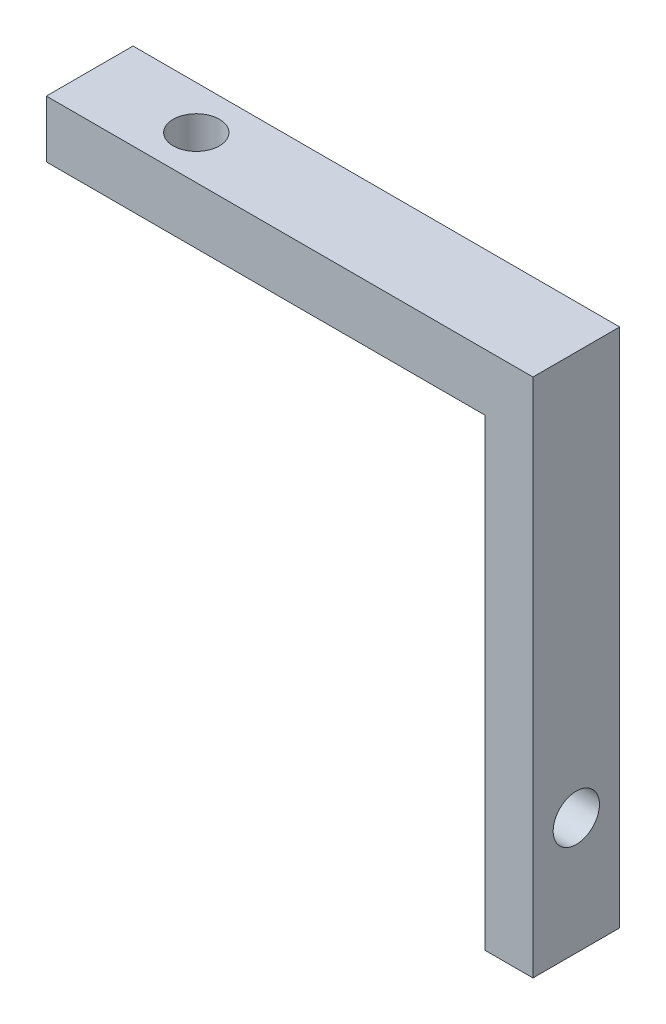
ISO-10303-21;
HEADER;
FILE_DESCRIPTION(('STEP AP214'),'2;1');
FILE_NAME('part.step','',(''),(''),'','','');
FILE_SCHEMA(('AUTOMOTIVE_DESIGN { 1 0 10303 214 1 1 1 1 }'));
ENDSEC;
DATA;
#1=APPLICATION_CONTEXT('core data for automotive mechanical design processes');
#2=APPLICATION_PROTOCOL_DEFINITION('international standard','automotive_design',2000,#1);
#3=PRODUCT_CONTEXT('',#1,'mechanical');
#4=PRODUCT('Part','Part','',(#3));
#5=PRODUCT_RELATED_PRODUCT_CATEGORY('part','',(#4));
#6=PRODUCT_DEFINITION_FORMATION('','',#4);
#7=PRODUCT_DEFINITION_CONTEXT('part definition',#1,'design');
#8=PRODUCT_DEFINITION('design','',#6,#7);
#9=PRODUCT_DEFINITION_SHAPE('','',#8);
#10=(LENGTH_UNIT() NAMED_UNIT(*) SI_UNIT(.MILLI.,.METRE.));
#11=(NAMED_UNIT(*) PLANE_ANGLE_UNIT() SI_UNIT($,.RADIAN.));
#12=(NAMED_UNIT(*) SI_UNIT($,.STERADIAN.) SOLID_ANGLE_UNIT());
#13=UNCERTAINTY_MEASURE_WITH_UNIT(LENGTH_MEASURE(1.E-05),#10,'distance_accuracy_value','');
#14=(GEOMETRIC_REPRESENTATION_CONTEXT(3) GLOBAL_UNCERTAINTY_ASSIGNED_CONTEXT((#13)) GLOBAL_UNIT_ASSIGNED_CONTEXT((#10,
#11,#12)) REPRESENTATION_CONTEXT('',''));
#15=CARTESIAN_POINT('',(0.,0.,0.));
#16=DIRECTION('',(0.,0.,1.));
#17=DIRECTION('',(1.,0.,0.));
#18=AXIS2_PLACEMENT_3D('',#15,#16,#17);
#19=CARTESIAN_POINT('',(-7.37838545486488,23.9693813166455,-3.));
#20=DIRECTION('',(-1.,0.,0.));
#21=DIRECTION('',(0.,0.,1.));
#22=AXIS2_PLACEMENT_3D('',#19,#20,#21);
#23=PLANE('',#22);
#24=DIRECTION('',(0.,0.,1.));
#25=VECTOR('',#24,1.);
#26=CARTESIAN_POINT('',(-7.37838545486488,23.9693813166455,-3.));
#27=LINE('',#26,#25);
#28=CARTESIAN_POINT('',(-7.37838545486488,23.9693813166455,-3.));
#29=VERTEX_POINT('',#28);
#30=CARTESIAN_POINT('',(-7.37838545486488,23.9693813166455,3.));
#31=VERTEX_POINT('',#30);
#32=EDGE_CURVE('E36',#29,#31,#27,.T.);
#33=ORIENTED_EDGE('',*,*,#32,.T.);
#34=DIRECTION('',(0.,-1.,0.));
#35=VECTOR('',#34,1.);
#36=CARTESIAN_POINT('',(-7.37838545486488,23.9693813166455,3.));
#37=LINE('',#36,#35);
#38=CARTESIAN_POINT('',(-7.37838545486488,27.916927213731,3.));
#39=VERTEX_POINT('',#38);
#40=EDGE_CURVE('E85',#39,#31,#37,.T.);
#41=ORIENTED_EDGE('',*,*,#40,.F.);
#42=DIRECTION('',(0.,0.,1.));
#43=VECTOR('',#42,1.);
#44=CARTESIAN_POINT('',(-7.37838545486488,27.916927213731,-3.));
#45=LINE('',#44,#43);
#46=CARTESIAN_POINT('',(-7.37838545486488,27.916927213731,-3.));
#47=VERTEX_POINT('',#46);
#48=EDGE_CURVE('E11',#47,#39,#45,.T.);
#49=ORIENTED_EDGE('',*,*,#48,.F.);
#50=DIRECTION('',(0.,-1.,0.));
#51=VECTOR('',#50,1.);
#52=CARTESIAN_POINT('',(-7.37838545486488,23.9693813166455,-3.));
#53=LINE('',#52,#51);
#54=EDGE_CURVE('E86',#47,#29,#53,.T.);
#55=ORIENTED_EDGE('',*,*,#54,.T.);
#56=EDGE_LOOP('',(#33,#41,#49,#55));
#57=FACE_BOUND('',#56,.T.);
#58=ADVANCED_FACE('F33',(#57),#23,.T.);
#59=CARTESIAN_POINT('',(-7.37838545486488,27.916927213731,-3.));
#60=DIRECTION('',(0.,1.,0.));
#61=DIRECTION('',(0.,0.,1.));
#62=AXIS2_PLACEMENT_3D('',#59,#60,#61);
#63=PLANE('',#62);
#64=CARTESIAN_POINT('',(0.,27.916927213731,0.));
#65=DIRECTION('',(0.,1.,0.));
#66=DIRECTION('',(0.,0.,1.));
#67=AXIS2_PLACEMENT_3D('',#64,#65,#66);
#68=CIRCLE('',#67,1.59999999999999);
#69=CARTESIAN_POINT('',(0.,27.916927213731,1.59999999999999));
#70=VERTEX_POINT('',#69);
#71=EDGE_CURVE('E107',#70,#70,#68,.T.);
#72=ORIENTED_EDGE('',*,*,#71,.F.);
#73=EDGE_LOOP('',(#72));
#74=FACE_BOUND('',#73,.T.);
#75=ORIENTED_EDGE('',*,*,#48,.T.);
#76=DIRECTION('',(-1.,0.,0.));
#77=VECTOR('',#76,1.);
#78=CARTESIAN_POINT('',(-7.37838545486488,27.916927213731,3.));
#79=LINE('',#78,#77);
#80=CARTESIAN_POINT('',(26.2991154796457,27.916927213731,3.));
#81=VERTEX_POINT('',#80);
#82=EDGE_CURVE('E103',#81,#39,#79,.T.);
#83=ORIENTED_EDGE('',*,*,#82,.F.);
#84=DIRECTION('',(0.,0.,1.));
#85=VECTOR('',#84,1.);
#86=CARTESIAN_POINT('',(26.2991154796457,27.916927213731,-3.));
#87=LINE('',#86,#85);
#88=CARTESIAN_POINT('',(26.2991154796457,27.916927213731,-3.));
#89=VERTEX_POINT('',#88);
#90=EDGE_CURVE('E41',#89,#81,#87,.T.);
#91=ORIENTED_EDGE('',*,*,#90,.F.);
#92=DIRECTION('',(-1.,0.,0.));
#93=VECTOR('',#92,1.);
#94=CARTESIAN_POINT('',(-7.37838545486488,27.916927213731,-3.));
#95=LINE('',#94,#93);
#96=EDGE_CURVE('E91',#89,#47,#95,.T.);
#97=ORIENTED_EDGE('',*,*,#96,.T.);
#98=EDGE_LOOP('',(#75,#83,#91,#97));
#99=FACE_BOUND('',#98,.T.);
#100=ADVANCED_FACE('F148',(#74,#99),#63,.T.);
#101=CARTESIAN_POINT('',(26.2991154796457,27.916927213731,-3.));
#102=DIRECTION('',(1.,0.,0.));
#103=DIRECTION('',(0.,0.,-1.));
#104=AXIS2_PLACEMENT_3D('',#101,#102,#103);
#105=PLANE('',#104);
#106=CARTESIAN_POINT('',(26.2991154796457,0.,0.));
#107=DIRECTION('',(1.,0.,0.));
#108=DIRECTION('',(0.,0.,-1.));
#109=AXIS2_PLACEMENT_3D('',#106,#107,#108);
#110=CIRCLE('',#109,1.59999999999999);
#111=CARTESIAN_POINT('',(26.2991154796457,0.,-1.59999999999999));
#112=VERTEX_POINT('',#111);
#113=EDGE_CURVE('E187',#112,#112,#110,.T.);
#114=ORIENTED_EDGE('',*,*,#113,.F.);
#115=EDGE_LOOP('',(#114));
#116=FACE_BOUND('',#115,.T.);
#117=ORIENTED_EDGE('',*,*,#90,.T.);
#118=DIRECTION('',(0.,1.,0.));
#119=VECTOR('',#118,1.);
#120=CARTESIAN_POINT('',(26.2991154796457,27.916927213731,3.));
#121=LINE('',#120,#119);
#122=CARTESIAN_POINT('',(26.2991154796457,-8.1044290971741,3.));
#123=VERTEX_POINT('',#122);
#124=EDGE_CURVE('E115',#123,#81,#121,.T.);
#125=ORIENTED_EDGE('',*,*,#124,.F.);
#126=DIRECTION('',(0.,0.,1.));
#127=VECTOR('',#126,1.);
#128=CARTESIAN_POINT('',(26.2991154796457,-8.1044290971741,-3.));
#129=LINE('',#128,#127);
#130=CARTESIAN_POINT('',(26.2991154796457,-8.1044290971741,-3.));
#131=VERTEX_POINT('',#130);
#132=EDGE_CURVE('E131',#131,#123,#129,.T.);
#133=ORIENTED_EDGE('',*,*,#132,.F.);
#134=DIRECTION('',(0.,1.,0.));
#135=VECTOR('',#134,1.);
#136=CARTESIAN_POINT('',(26.2991154796457,27.916927213731,-3.));
#137=LINE('',#136,#135);
#138=EDGE_CURVE('E127',#131,#89,#137,.T.);
#139=ORIENTED_EDGE('',*,*,#138,.T.);
#140=EDGE_LOOP('',(#117,#125,#133,#139));
#141=FACE_BOUND('',#140,.T.);
#142=ADVANCED_FACE('F144',(#116,#141),#105,.T.);
#143=CARTESIAN_POINT('',(26.2991154796457,-8.1044290971741,-3.));
#144=DIRECTION('',(0.,-1.,0.));
#145=DIRECTION('',(0.,0.,-1.));
#146=AXIS2_PLACEMENT_3D('',#143,#144,#145);
#147=PLANE('',#146);
#148=ORIENTED_EDGE('',*,*,#132,.T.);
#149=DIRECTION('',(1.,0.,0.));
#150=VECTOR('',#149,1.);
#151=CARTESIAN_POINT('',(26.2991154796457,-8.1044290971741,3.));
#152=LINE('',#151,#150);
#153=CARTESIAN_POINT('',(22.9683736289798,-8.1044290971741,3.));
#154=VERTEX_POINT('',#153);
#155=EDGE_CURVE('E112',#154,#123,#152,.T.);
#156=ORIENTED_EDGE('',*,*,#155,.F.);
#157=DIRECTION('',(0.,0.,1.));
#158=VECTOR('',#157,1.);
#159=CARTESIAN_POINT('',(22.9683736289798,-8.1044290971741,-3.));
#160=LINE('',#159,#158);
#161=CARTESIAN_POINT('',(22.9683736289798,-8.1044290971741,-3.));
#162=VERTEX_POINT('',#161);
#163=EDGE_CURVE('E133',#162,#154,#160,.T.);
#164=ORIENTED_EDGE('',*,*,#163,.F.);
#165=DIRECTION('',(1.,0.,0.));
#166=VECTOR('',#165,1.);
#167=CARTESIAN_POINT('',(26.2991154796457,-8.1044290971741,-3.));
#168=LINE('',#167,#166);
#169=EDGE_CURVE('E124',#162,#131,#168,.T.);
#170=ORIENTED_EDGE('',*,*,#169,.T.);
#171=EDGE_LOOP('',(#148,#156,#164,#170));
#172=FACE_BOUND('',#171,.T.);
#173=ADVANCED_FACE('F141',(#172),#147,.T.);
#174=CARTESIAN_POINT('',(22.9683736289798,23.9693813166455,-3.));
#175=DIRECTION('',(-1.,0.,0.));
#176=DIRECTION('',(0.,0.,1.));
#177=AXIS2_PLACEMENT_3D('',#174,#175,#176);
#178=PLANE('',#177);
#179=CARTESIAN_POINT('',(22.9683736289798,0.,0.));
#180=DIRECTION('',(-1.,0.,0.));
#181=DIRECTION('',(0.,0.,1.));
#182=AXIS2_PLACEMENT_3D('',#179,#180,#181);
#183=CIRCLE('',#182,1.59999999999999);
#184=CARTESIAN_POINT('',(22.9683736289798,0.,1.59999999999999));
#185=VERTEX_POINT('',#184);
#186=EDGE_CURVE('E185',#185,#185,#183,.T.);
#187=ORIENTED_EDGE('',*,*,#186,.F.);
#188=EDGE_LOOP('',(#187));
#189=FACE_BOUND('',#188,.T.);
#190=ORIENTED_EDGE('',*,*,#163,.T.);
#191=DIRECTION('',(0.,-1.,0.));
#192=VECTOR('',#191,1.);
#193=CARTESIAN_POINT('',(22.9683736289798,23.9693813166455,3.));
#194=LINE('',#193,#192);
#195=CARTESIAN_POINT('',(22.9683736289798,23.9693813166455,3.));
#196=VERTEX_POINT('',#195);
#197=EDGE_CURVE('E98',#196,#154,#194,.T.);
#198=ORIENTED_EDGE('',*,*,#197,.F.);
#199=DIRECTION('',(0.,0.,1.));
#200=VECTOR('',#199,1.);
#201=CARTESIAN_POINT('',(22.9683736289798,23.9693813166455,-3.));
#202=LINE('',#201,#200);
#203=CARTESIAN_POINT('',(22.9683736289798,23.9693813166455,-3.));
#204=VERTEX_POINT('',#203);
#205=EDGE_CURVE('E90',#204,#196,#202,.T.);
#206=ORIENTED_EDGE('',*,*,#205,.F.);
#207=DIRECTION('',(0.,-1.,0.));
#208=VECTOR('',#207,1.);
#209=CARTESIAN_POINT('',(22.9683736289798,23.9693813166455,-3.));
#210=LINE('',#209,#208);
#211=EDGE_CURVE('E121',#204,#162,#210,.T.);
#212=ORIENTED_EDGE('',*,*,#211,.T.);
#213=EDGE_LOOP('',(#190,#198,#206,#212));
#214=FACE_BOUND('',#213,.T.);
#215=ADVANCED_FACE('F135',(#189,#214),#178,.T.);
#216=CARTESIAN_POINT('',(-7.37838545486488,23.9693813166455,-3.));
#217=DIRECTION('',(0.,-1.,0.));
#218=DIRECTION('',(0.,0.,-1.));
#219=AXIS2_PLACEMENT_3D('',#216,#217,#218);
#220=PLANE('',#219);
#221=CARTESIAN_POINT('',(0.,23.9693813166455,0.));
#222=DIRECTION('',(0.,-1.,0.));
#223=DIRECTION('',(0.,0.,-1.));
#224=AXIS2_PLACEMENT_3D('',#221,#222,#223);
#225=CIRCLE('',#224,1.59999999999999);
#226=CARTESIAN_POINT('',(0.,23.9693813166455,-1.59999999999999));
#227=VERTEX_POINT('',#226);
#228=EDGE_CURVE('E104',#227,#227,#225,.T.);
#229=ORIENTED_EDGE('',*,*,#228,.F.);
#230=EDGE_LOOP('',(#229));
#231=FACE_BOUND('',#230,.T.);
#232=ORIENTED_EDGE('',*,*,#205,.T.);
#233=DIRECTION('',(1.,0.,0.));
#234=VECTOR('',#233,1.);
#235=CARTESIAN_POINT('',(-7.37838545486488,23.9693813166455,3.));
#236=LINE('',#235,#234);
#237=EDGE_CURVE('E93',#31,#196,#236,.T.);
#238=ORIENTED_EDGE('',*,*,#237,.F.);
#239=ORIENTED_EDGE('',*,*,#32,.F.);
#240=DIRECTION('',(1.,0.,0.));
#241=VECTOR('',#240,1.);
#242=CARTESIAN_POINT('',(-7.37838545486488,23.9693813166455,-3.));
#243=LINE('',#242,#241);
#244=EDGE_CURVE('E119',#29,#204,#243,.T.);
#245=ORIENTED_EDGE('',*,*,#244,.T.);
#246=EDGE_LOOP('',(#232,#238,#239,#245));
#247=FACE_BOUND('',#246,.T.);
#248=ADVANCED_FACE('F94',(#231,#247),#220,.T.);
#249=CARTESIAN_POINT('',(0.,0.,-3.));
#250=DIRECTION('',(0.,0.,-1.));
#251=DIRECTION('',(-1.,0.,0.));
#252=AXIS2_PLACEMENT_3D('',#249,#250,#251);
#253=PLANE('',#252);
#254=ORIENTED_EDGE('',*,*,#54,.F.);
#255=ORIENTED_EDGE('',*,*,#96,.F.);
#256=ORIENTED_EDGE('',*,*,#138,.F.);
#257=ORIENTED_EDGE('',*,*,#169,.F.);
#258=ORIENTED_EDGE('',*,*,#211,.F.);
#259=ORIENTED_EDGE('',*,*,#244,.F.);
#260=EDGE_LOOP('',(#254,#255,#256,#257,#258,#259));
#261=FACE_BOUND('',#260,.T.);
#262=ADVANCED_FACE('F147',(#261),#253,.T.);
#263=CARTESIAN_POINT('',(0.,0.,3.));
#264=DIRECTION('',(0.,0.,-1.));
#265=DIRECTION('',(-1.,0.,0.));
#266=AXIS2_PLACEMENT_3D('',#263,#264,#265);
#267=PLANE('',#266);
#268=ORIENTED_EDGE('',*,*,#40,.T.);
#269=ORIENTED_EDGE('',*,*,#237,.T.);
#270=ORIENTED_EDGE('',*,*,#197,.T.);
#271=ORIENTED_EDGE('',*,*,#155,.T.);
#272=ORIENTED_EDGE('',*,*,#124,.T.);
#273=ORIENTED_EDGE('',*,*,#82,.T.);
#274=EDGE_LOOP('',(#268,#269,#270,#271,#272,#273));
#275=FACE_BOUND('',#274,.T.);
#276=ADVANCED_FACE('F101',(#275),#267,.F.);
#277=CARTESIAN_POINT('',(0.,27.916927213731,0.));
#278=DIRECTION('',(0.,1.,0.));
#279=DIRECTION('',(0.,0.,1.));
#280=AXIS2_PLACEMENT_3D('',#277,#278,#279);
#281=CYLINDRICAL_SURFACE('',#280,1.59999999999999);
#282=ORIENTED_EDGE('',*,*,#71,.T.);
#283=EDGE_LOOP('',(#282));
#284=FACE_BOUND('',#283,.T.);
#285=ORIENTED_EDGE('',*,*,#228,.T.);
#286=EDGE_LOOP('',(#285));
#287=FACE_BOUND('',#286,.T.);
#288=ADVANCED_FACE('F173',(#284,#287),#281,.F.);
#289=CARTESIAN_POINT('',(26.2991154796457,0.,0.));
#290=DIRECTION('',(1.,0.,0.));
#291=DIRECTION('',(0.,0.,-1.));
#292=AXIS2_PLACEMENT_3D('',#289,#290,#291);
#293=CYLINDRICAL_SURFACE('',#292,1.59999999999999);
#294=ORIENTED_EDGE('',*,*,#113,.T.);
#295=EDGE_LOOP('',(#294));
#296=FACE_BOUND('',#295,.T.);
#297=ORIENTED_EDGE('',*,*,#186,.T.);
#298=EDGE_LOOP('',(#297));
#299=FACE_BOUND('',#298,.T.);
#300=ADVANCED_FACE('F175',(#296,#299),#293,.F.);
#301=CLOSED_SHELL('',(#58,#100,#142,#173,#215,#248,#262,#276,#288,#300));
#302=MANIFOLD_SOLID_BREP('B2',#301);
#303=ADVANCED_BREP_SHAPE_REPRESENTATION('',(#18,#302),#14);
#304=SHAPE_DEFINITION_REPRESENTATION(#9,#303);
ENDSEC;
END-ISO-10303-21;
